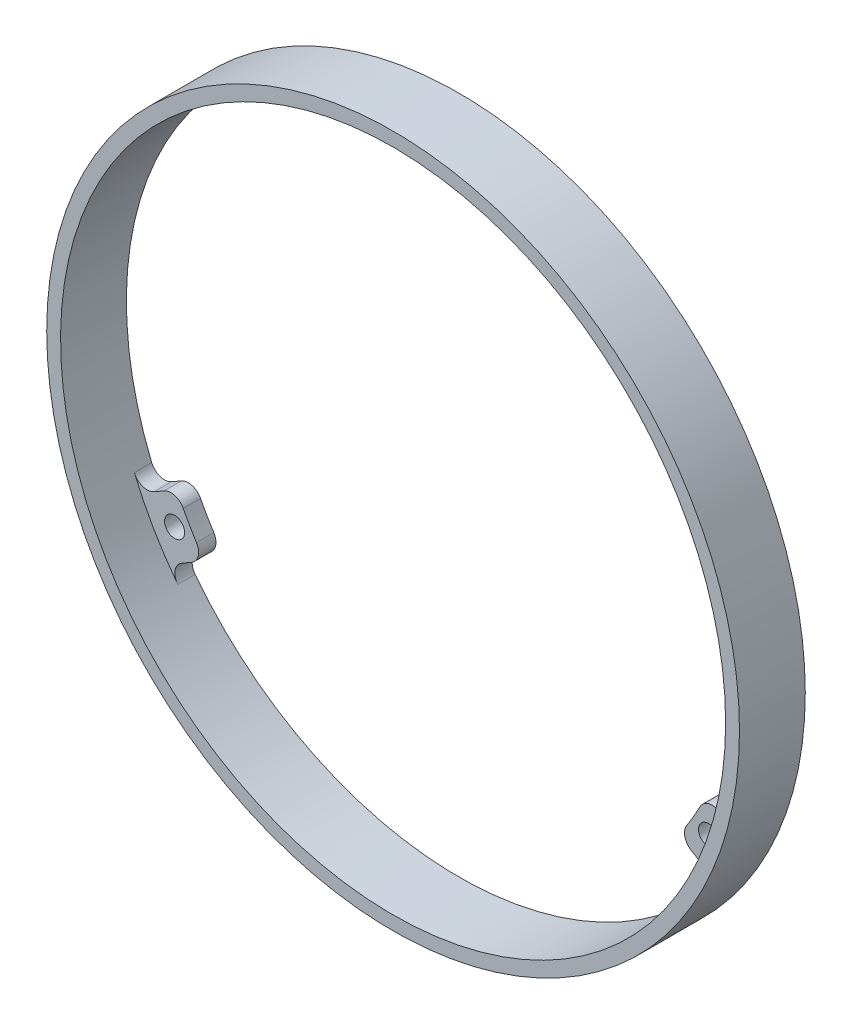
ISO-10303-21;
HEADER;
FILE_DESCRIPTION(('STEP AP214'),'2;1');
FILE_NAME('part.step','',(''),(''),'','','');
FILE_SCHEMA(('AUTOMOTIVE_DESIGN { 1 0 10303 214 1 1 1 1 }'));
ENDSEC;
DATA;
#1=APPLICATION_CONTEXT('core data for automotive mechanical design processes');
#2=APPLICATION_PROTOCOL_DEFINITION('international standard','automotive_design',2000,#1);
#3=PRODUCT_CONTEXT('',#1,'mechanical');
#4=PRODUCT('Part','Part','',(#3));
#5=PRODUCT_RELATED_PRODUCT_CATEGORY('part','',(#4));
#6=PRODUCT_DEFINITION_FORMATION('','',#4);
#7=PRODUCT_DEFINITION_CONTEXT('part definition',#1,'design');
#8=PRODUCT_DEFINITION('design','',#6,#7);
#9=PRODUCT_DEFINITION_SHAPE('','',#8);
#10=(LENGTH_UNIT() NAMED_UNIT(*) SI_UNIT(.MILLI.,.METRE.));
#11=(NAMED_UNIT(*) PLANE_ANGLE_UNIT() SI_UNIT($,.RADIAN.));
#12=(NAMED_UNIT(*) SI_UNIT($,.STERADIAN.) SOLID_ANGLE_UNIT());
#13=UNCERTAINTY_MEASURE_WITH_UNIT(LENGTH_MEASURE(1.E-05),#10,'distance_accuracy_value','');
#14=(GEOMETRIC_REPRESENTATION_CONTEXT(3) GLOBAL_UNCERTAINTY_ASSIGNED_CONTEXT((#13)) GLOBAL_UNIT_ASSIGNED_CONTEXT((#10,
#11,#12)) REPRESENTATION_CONTEXT('',''));
#15=CARTESIAN_POINT('',(0.,0.,0.));
#16=DIRECTION('',(0.,0.,1.));
#17=DIRECTION('',(1.,0.,0.));
#18=AXIS2_PLACEMENT_3D('',#15,#16,#17);
#19=CARTESIAN_POINT('',(0.,0.,9.5));
#20=DIRECTION('',(0.,0.,-1.));
#21=DIRECTION('',(-1.,0.,0.));
#22=AXIS2_PLACEMENT_3D('',#19,#20,#21);
#23=CYLINDRICAL_SURFACE('',#22,48.);
#24=CARTESIAN_POINT('',(0.,0.,9.5));
#25=DIRECTION('',(0.,0.,1.));
#26=DIRECTION('',(1.,0.,0.));
#27=AXIS2_PLACEMENT_3D('',#24,#25,#26);
#28=CIRCLE('',#27,48.);
#29=CARTESIAN_POINT('',(48.,0.,9.5));
#30=VERTEX_POINT('',#29);
#31=EDGE_CURVE('E238',#30,#30,#28,.T.);
#32=ORIENTED_EDGE('',*,*,#31,.T.);
#33=EDGE_LOOP('',(#32));
#34=FACE_BOUND('',#33,.T.);
#35=CARTESIAN_POINT('',(0.,0.,0.));
#36=DIRECTION('',(0.,0.,1.));
#37=DIRECTION('',(1.,0.,0.));
#38=AXIS2_PLACEMENT_3D('',#35,#36,#37);
#39=CIRCLE('',#38,48.);
#40=CARTESIAN_POINT('',(44.3445238082748,-18.3728933001134,0.));
#41=VERTEX_POINT('',#40);
#42=CARTESIAN_POINT('',(6.26086956521696,47.5899307867467,0.));
#43=VERTEX_POINT('',#42);
#44=EDGE_CURVE('E245',#41,#43,#39,.T.);
#45=ORIENTED_EDGE('',*,*,#44,.F.);
#46=DIRECTION('',(0.,0.,-1.));
#47=VECTOR('',#46,1.);
#48=CARTESIAN_POINT('',(44.3445238082748,-18.3728933001134,9.5));
#49=LINE('',#48,#47);
#50=CARTESIAN_POINT('',(44.3445238082748,-18.3728933001134,2.5));
#51=VERTEX_POINT('',#50);
#52=EDGE_CURVE('E323',#41,#51,#49,.F.);
#53=ORIENTED_EDGE('',*,*,#52,.T.);
#54=CARTESIAN_POINT('',(0.,0.,2.5));
#55=DIRECTION('',(0.,0.,1.));
#56=DIRECTION('',(-0.499999999999992,-0.866025403784443,0.));
#57=AXIS2_PLACEMENT_3D('',#54,#55,#56);
#58=CIRCLE('',#57,48.);
#59=CARTESIAN_POINT('',(38.0836542430576,-29.2170374866317,2.5));
#60=VERTEX_POINT('',#59);
#61=EDGE_CURVE('E357',#60,#51,#58,.T.);
#62=ORIENTED_EDGE('',*,*,#61,.F.);
#63=DIRECTION('',(0.,0.,-1.));
#64=VECTOR('',#63,1.);
#65=CARTESIAN_POINT('',(38.0836542430576,-29.2170374866317,9.5));
#66=LINE('',#65,#64);
#67=CARTESIAN_POINT('',(38.0836542430576,-29.2170374866317,0.));
#68=VERTEX_POINT('',#67);
#69=EDGE_CURVE('E320',#60,#68,#66,.T.);
#70=ORIENTED_EDGE('',*,*,#69,.T.);
#71=CARTESIAN_POINT('',(-38.0836542430566,-29.2170374866329,0.));
#72=VERTEX_POINT('',#71);
#73=EDGE_CURVE('E244',#72,#68,#39,.T.);
#74=ORIENTED_EDGE('',*,*,#73,.F.);
#75=DIRECTION('',(0.,0.,-1.));
#76=VECTOR('',#75,1.);
#77=CARTESIAN_POINT('',(-38.0836542430566,-29.2170374866329,9.5));
#78=LINE('',#77,#76);
#79=CARTESIAN_POINT('',(-38.0836542430566,-29.2170374866329,2.5));
#80=VERTEX_POINT('',#79);
#81=EDGE_CURVE('E285',#72,#80,#78,.F.);
#82=ORIENTED_EDGE('',*,*,#81,.T.);
#83=CARTESIAN_POINT('',(0.,0.,2.5));
#84=DIRECTION('',(0.,0.,1.));
#85=DIRECTION('',(-0.500000000000004,0.866025403784436,0.));
#86=AXIS2_PLACEMENT_3D('',#83,#84,#85);
#87=CIRCLE('',#86,48.);
#88=CARTESIAN_POINT('',(-44.3445238082742,-18.3728933001148,2.5));
#89=VERTEX_POINT('',#88);
#90=EDGE_CURVE('E380',#89,#80,#87,.T.);
#91=ORIENTED_EDGE('',*,*,#90,.F.);
#92=DIRECTION('',(0.,0.,-1.));
#93=VECTOR('',#92,1.);
#94=CARTESIAN_POINT('',(-44.3445238082742,-18.3728933001148,9.5));
#95=LINE('',#94,#93);
#96=CARTESIAN_POINT('',(-44.3445238082742,-18.3728933001148,0.));
#97=VERTEX_POINT('',#96);
#98=EDGE_CURVE('E282',#89,#97,#95,.T.);
#99=ORIENTED_EDGE('',*,*,#98,.T.);
#100=CARTESIAN_POINT('',(-6.26086956521783,47.5899307867466,0.));
#101=VERTEX_POINT('',#100);
#102=EDGE_CURVE('E242',#101,#97,#39,.T.);
#103=ORIENTED_EDGE('',*,*,#102,.F.);
#104=DIRECTION('',(0.,0.,-1.));
#105=VECTOR('',#104,1.);
#106=CARTESIAN_POINT('',(-6.26086956521783,47.5899307867466,9.5));
#107=LINE('',#106,#105);
#108=CARTESIAN_POINT('',(-6.26086956521783,47.5899307867466,2.5));
#109=VERTEX_POINT('',#108);
#110=EDGE_CURVE('E199',#101,#109,#107,.F.);
#111=ORIENTED_EDGE('',*,*,#110,.T.);
#112=CARTESIAN_POINT('',(0.,0.,2.5));
#113=DIRECTION('',(0.,0.,1.));
#114=DIRECTION('',(1.,0.,0.));
#115=AXIS2_PLACEMENT_3D('',#112,#113,#114);
#116=CIRCLE('',#115,48.);
#117=CARTESIAN_POINT('',(6.26086956521695,47.5899307867467,2.5));
#118=VERTEX_POINT('',#117);
#119=EDGE_CURVE('E237',#118,#109,#116,.T.);
#120=ORIENTED_EDGE('',*,*,#119,.F.);
#121=DIRECTION('',(0.,0.,-1.));
#122=VECTOR('',#121,1.);
#123=CARTESIAN_POINT('',(6.26086956521696,47.5899307867467,9.5));
#124=LINE('',#123,#122);
#125=EDGE_CURVE('E215',#118,#43,#124,.T.);
#126=ORIENTED_EDGE('',*,*,#125,.T.);
#127=EDGE_LOOP('',(#45,#53,#62,#70,#74,#82,#91,#99,#103,#111,#120,#126));
#128=FACE_BOUND('',#127,.T.);
#129=ADVANCED_FACE('F30',(#34,#128),#23,.F.);
#130=CARTESIAN_POINT('',(0.,0.,9.5));
#131=DIRECTION('',(0.,0.,1.));
#132=DIRECTION('',(1.,0.,0.));
#133=AXIS2_PLACEMENT_3D('',#130,#131,#132);
#134=PLANE('',#133);
#135=CARTESIAN_POINT('',(0.,0.,9.5));
#136=DIRECTION('',(0.,0.,1.));
#137=DIRECTION('',(1.,0.,0.));
#138=AXIS2_PLACEMENT_3D('',#135,#136,#137);
#139=CIRCLE('',#138,50.);
#140=CARTESIAN_POINT('',(50.,0.,9.5));
#141=VERTEX_POINT('',#140);
#142=EDGE_CURVE('E246',#141,#141,#139,.T.);
#143=ORIENTED_EDGE('',*,*,#142,.T.);
#144=EDGE_LOOP('',(#143));
#145=FACE_BOUND('',#144,.T.);
#146=ORIENTED_EDGE('',*,*,#31,.F.);
#147=EDGE_LOOP('',(#146));
#148=FACE_BOUND('',#147,.T.);
#149=ADVANCED_FACE('F434',(#145,#148),#134,.T.);
#150=CARTESIAN_POINT('',(0.,0.,0.));
#151=DIRECTION('',(0.,0.,1.));
#152=DIRECTION('',(1.,0.,0.));
#153=AXIS2_PLACEMENT_3D('',#150,#151,#152);
#154=PLANE('',#153);
#155=CARTESIAN_POINT('',(38.5381304684077,-22.2499999999996,0.));
#156=DIRECTION('',(0.,0.,1.));
#157=DIRECTION('',(-0.499999999999992,-0.866025403784443,0.));
#158=AXIS2_PLACEMENT_3D('',#155,#156,#157);
#159=CIRCLE('',#158,1.45);
#160=CARTESIAN_POINT('',(37.8131304684077,-23.5057368354871,0.));
#161=VERTEX_POINT('',#160);
#162=EDGE_CURVE('E508',#161,#161,#159,.T.);
#163=ORIENTED_EDGE('',*,*,#162,.T.);
#164=EDGE_LOOP('',(#163));
#165=FACE_BOUND('',#164,.T.);
#166=CARTESIAN_POINT('',(-38.5381304684074,-22.2500000000002,0.));
#167=DIRECTION('',(0.,0.,1.));
#168=DIRECTION('',(-0.500000000000004,0.866025403784436,0.));
#169=AXIS2_PLACEMENT_3D('',#166,#167,#168);
#170=CIRCLE('',#169,1.45);
#171=CARTESIAN_POINT('',(-39.2631304684074,-20.9942631645127,0.));
#172=VERTEX_POINT('',#171);
#173=EDGE_CURVE('E378',#172,#172,#170,.T.);
#174=ORIENTED_EDGE('',*,*,#173,.T.);
#175=EDGE_LOOP('',(#174));
#176=FACE_BOUND('',#175,.T.);
#177=CARTESIAN_POINT('',(0.,44.5,0.));
#178=DIRECTION('',(0.,0.,1.));
#179=DIRECTION('',(1.,0.,0.));
#180=AXIS2_PLACEMENT_3D('',#177,#178,#179);
#181=CIRCLE('',#180,1.45);
#182=CARTESIAN_POINT('',(1.45,44.5,0.));
#183=VERTEX_POINT('',#182);
#184=EDGE_CURVE('E223',#183,#183,#181,.T.);
#185=ORIENTED_EDGE('',*,*,#184,.T.);
#186=EDGE_LOOP('',(#185));
#187=FACE_BOUND('',#186,.T.);
#188=CARTESIAN_POINT('',(0.,0.,0.));
#189=DIRECTION('',(0.,0.,1.));
#190=DIRECTION('',(1.,0.,0.));
#191=AXIS2_PLACEMENT_3D('',#188,#189,#190);
#192=CIRCLE('',#191,50.);
#193=CARTESIAN_POINT('',(50.,0.,0.));
#194=VERTEX_POINT('',#193);
#195=EDGE_CURVE('E241',#194,#194,#192,.T.);
#196=ORIENTED_EDGE('',*,*,#195,.F.);
#197=EDGE_LOOP('',(#196));
#198=FACE_BOUND('',#197,.T.);
#199=DIRECTION('',(0.866025403784439,-0.5,0.));
#200=VECTOR('',#199,1.);
#201=CARTESIAN_POINT('',(39.4246303544165,-27.3806231013399,0.));
#202=LINE('',#201,#200);
#203=CARTESIAN_POINT('',(36.065732621349,-25.441362590973,0.));
#204=VERTEX_POINT('',#203);
#205=CARTESIAN_POINT('',(37.4968353162635,-26.2676101171198,0.));
#206=VERTEX_POINT('',#205);
#207=EDGE_CURVE('E347',#204,#206,#202,.T.);
#208=ORIENTED_EDGE('',*,*,#207,.F.);
#209=CARTESIAN_POINT('',(37.065732621349,-23.7093117834041,0.));
#210=DIRECTION('',(0.,0.,1.));
#211=DIRECTION('',(1.,0.,0.));
#212=AXIS2_PLACEMENT_3D('',#209,#210,#211);
#213=CIRCLE('',#212,2.);
#214=CARTESIAN_POINT('',(35.3809265931059,-22.6316157932493,0.));
#215=VERTEX_POINT('',#214);
#216=EDGE_CURVE('E333',#204,#215,#213,.F.);
#217=ORIENTED_EDGE('',*,*,#216,.T.);
#218=CARTESIAN_POINT('',(0.,0.,0.));
#219=DIRECTION('',(0.,0.,-1.));
#220=DIRECTION('',(-0.499999999999992,-0.866025403784443,0.));
#221=AXIS2_PLACEMENT_3D('',#218,#219,#220);
#222=CIRCLE('',#221,42.);
#223=CARTESIAN_POINT('',(37.2900175021967,-19.324973342436,0.));
#224=VERTEX_POINT('',#223);
#225=EDGE_CURVE('E358',#224,#215,#222,.T.);
#226=ORIENTED_EDGE('',*,*,#225,.F.);
#227=CARTESIAN_POINT('',(39.0657326213489,-20.2452101682663,0.));
#228=DIRECTION('',(0.,0.,1.));
#229=DIRECTION('',(1.,0.,0.));
#230=AXIS2_PLACEMENT_3D('',#227,#228,#229);
#231=CIRCLE('',#230,2.);
#232=CARTESIAN_POINT('',(40.0657326213489,-18.5131593606974,0.));
#233=VERTEX_POINT('',#232);
#234=EDGE_CURVE('E331',#224,#233,#231,.F.);
#235=ORIENTED_EDGE('',*,*,#234,.T.);
#236=DIRECTION('',(-0.866025403784439,0.5,0.));
#237=VECTOR('',#236,1.);
#238=CARTESIAN_POINT('',(43.4246303544163,-20.4524198710643,0.));
#239=LINE('',#238,#237);
#240=CARTESIAN_POINT('',(41.4968353162633,-19.3394068868442,0.));
#241=VERTEX_POINT('',#240);
#242=EDGE_CURVE('E375',#241,#233,#239,.T.);
#243=ORIENTED_EDGE('',*,*,#242,.F.);
#244=CARTESIAN_POINT('',(42.4968353162633,-17.6073560792753,0.));
#245=DIRECTION('',(0.,0.,1.));
#246=DIRECTION('',(1.,0.,0.));
#247=AXIS2_PLACEMENT_3D('',#244,#245,#246);
#248=CIRCLE('',#247,2.);
#249=EDGE_CURVE('E342',#241,#41,#248,.T.);
#250=ORIENTED_EDGE('',*,*,#249,.T.);
#251=ORIENTED_EDGE('',*,*,#44,.T.);
#252=CARTESIAN_POINT('',(5.99999999999958,45.6070170039656,0.));
#253=DIRECTION('',(0.,0.,1.));
#254=DIRECTION('',(1.,0.,0.));
#255=AXIS2_PLACEMENT_3D('',#252,#253,#254);
#256=CIRCLE('',#255,2.);
#257=CARTESIAN_POINT('',(3.99999999999958,45.6070170039656,0.));
#258=VERTEX_POINT('',#257);
#259=EDGE_CURVE('E272',#43,#258,#256,.T.);
#260=ORIENTED_EDGE('',*,*,#259,.T.);
#261=DIRECTION('',(0.,1.,0.));
#262=VECTOR('',#261,1.);
#263=CARTESIAN_POINT('',(3.9999999999996,47.8330429724056,0.));
#264=LINE('',#263,#262);
#265=CARTESIAN_POINT('',(3.99999999999957,43.9545219516718,0.));
#266=VERTEX_POINT('',#265);
#267=EDGE_CURVE('E226',#266,#258,#264,.T.);
#268=ORIENTED_EDGE('',*,*,#267,.F.);
#269=CARTESIAN_POINT('',(1.99999999999957,43.9545219516719,0.));
#270=DIRECTION('',(0.,0.,1.));
#271=DIRECTION('',(1.,0.,0.));
#272=AXIS2_PLACEMENT_3D('',#269,#270,#271);
#273=CIRCLE('',#272,2.);
#274=CARTESIAN_POINT('',(1.9090909090905,41.9565891356868,0.));
#275=VERTEX_POINT('',#274);
#276=EDGE_CURVE('E261',#266,#275,#273,.F.);
#277=ORIENTED_EDGE('',*,*,#276,.T.);
#278=CARTESIAN_POINT('',(0.,0.,0.));
#279=DIRECTION('',(0.,0.,-1.));
#280=DIRECTION('',(1.,0.,0.));
#281=AXIS2_PLACEMENT_3D('',#278,#279,#280);
#282=CIRCLE('',#281,42.);
#283=CARTESIAN_POINT('',(-1.90909090909132,41.9565891356867,0.));
#284=VERTEX_POINT('',#283);
#285=EDGE_CURVE('E222',#284,#275,#282,.T.);
#286=ORIENTED_EDGE('',*,*,#285,.F.);
#287=CARTESIAN_POINT('',(-2.00000000000043,43.9545219516718,0.));
#288=DIRECTION('',(0.,0.,1.));
#289=DIRECTION('',(1.,0.,0.));
#290=AXIS2_PLACEMENT_3D('',#287,#288,#289);
#291=CIRCLE('',#290,2.);
#292=CARTESIAN_POINT('',(-4.00000000000043,43.9545219516718,0.));
#293=VERTEX_POINT('',#292);
#294=EDGE_CURVE('E221',#284,#293,#291,.F.);
#295=ORIENTED_EDGE('',*,*,#294,.T.);
#296=DIRECTION('',(0.,-1.,0.));
#297=VECTOR('',#296,1.);
#298=CARTESIAN_POINT('',(-4.0000000000004,47.8330429724056,0.));
#299=LINE('',#298,#297);
#300=CARTESIAN_POINT('',(-4.00000000000042,45.6070170039655,0.));
#301=VERTEX_POINT('',#300);
#302=EDGE_CURVE('E211',#301,#293,#299,.T.);
#303=ORIENTED_EDGE('',*,*,#302,.F.);
#304=CARTESIAN_POINT('',(-6.00000000000042,45.6070170039655,0.));
#305=DIRECTION('',(0.,0.,1.));
#306=DIRECTION('',(1.,0.,0.));
#307=AXIS2_PLACEMENT_3D('',#304,#305,#306);
#308=CIRCLE('',#307,2.);
#309=EDGE_CURVE('E193',#301,#101,#308,.T.);
#310=ORIENTED_EDGE('',*,*,#309,.T.);
#311=ORIENTED_EDGE('',*,*,#102,.T.);
#312=CARTESIAN_POINT('',(-42.4968353162628,-17.6073560792767,0.));
#313=DIRECTION('',(0.,0.,1.));
#314=DIRECTION('',(1.,0.,0.));
#315=AXIS2_PLACEMENT_3D('',#312,#313,#314);
#316=CIRCLE('',#315,2.);
#317=CARTESIAN_POINT('',(-41.4968353162628,-19.3394068868456,0.));
#318=VERTEX_POINT('',#317);
#319=EDGE_CURVE('E310',#97,#318,#316,.T.);
#320=ORIENTED_EDGE('',*,*,#319,.T.);
#321=DIRECTION('',(-0.866025403784441,-0.499999999999997,0.));
#322=VECTOR('',#321,1.);
#323=CARTESIAN_POINT('',(-43.4246303544157,-20.4524198710656,0.));
#324=LINE('',#323,#322);
#325=CARTESIAN_POINT('',(-40.0657326213483,-18.5131593606987,0.));
#326=VERTEX_POINT('',#325);
#327=EDGE_CURVE('E383',#326,#318,#324,.T.);
#328=ORIENTED_EDGE('',*,*,#327,.F.);
#329=CARTESIAN_POINT('',(-39.0657326213483,-20.2452101682676,0.));
#330=DIRECTION('',(0.,0.,1.));
#331=DIRECTION('',(1.,0.,0.));
#332=AXIS2_PLACEMENT_3D('',#329,#330,#331);
#333=CIRCLE('',#332,2.);
#334=CARTESIAN_POINT('',(-37.2900175021961,-19.3249733424373,0.));
#335=VERTEX_POINT('',#334);
#336=EDGE_CURVE('E295',#326,#335,#333,.F.);
#337=ORIENTED_EDGE('',*,*,#336,.T.);
#338=CARTESIAN_POINT('',(0.,0.,0.));
#339=DIRECTION('',(0.,0.,-1.));
#340=DIRECTION('',(-0.500000000000004,0.866025403784436,0.));
#341=AXIS2_PLACEMENT_3D('',#338,#339,#340);
#342=CIRCLE('',#341,42.);
#343=CARTESIAN_POINT('',(-35.3809265931051,-22.6316157932505,0.));
#344=VERTEX_POINT('',#343);
#345=EDGE_CURVE('E369',#344,#335,#342,.T.);
#346=ORIENTED_EDGE('',*,*,#345,.F.);
#347=CARTESIAN_POINT('',(-37.0657326213482,-23.7093117834053,0.));
#348=DIRECTION('',(0.,0.,1.));
#349=DIRECTION('',(1.,0.,0.));
#350=AXIS2_PLACEMENT_3D('',#347,#348,#349);
#351=CIRCLE('',#350,2.);
#352=CARTESIAN_POINT('',(-36.0657326213482,-25.4413625909742,0.));
#353=VERTEX_POINT('',#352);
#354=EDGE_CURVE('E293',#344,#353,#351,.F.);
#355=ORIENTED_EDGE('',*,*,#354,.T.);
#356=DIRECTION('',(0.866025403784441,0.499999999999996,0.));
#357=VECTOR('',#356,1.);
#358=CARTESIAN_POINT('',(-39.4246303544156,-27.3806231013411,0.));
#359=LINE('',#358,#357);
#360=CARTESIAN_POINT('',(-37.4968353162626,-26.267610117121,0.));
#361=VERTEX_POINT('',#360);
#362=EDGE_CURVE('E365',#361,#353,#359,.T.);
#363=ORIENTED_EDGE('',*,*,#362,.F.);
#364=CARTESIAN_POINT('',(-36.4968353162626,-27.9996609246899,0.));
#365=DIRECTION('',(0.,0.,1.));
#366=DIRECTION('',(1.,0.,0.));
#367=AXIS2_PLACEMENT_3D('',#364,#365,#366);
#368=CIRCLE('',#367,2.);
#369=EDGE_CURVE('E306',#361,#72,#368,.T.);
#370=ORIENTED_EDGE('',*,*,#369,.T.);
#371=ORIENTED_EDGE('',*,*,#73,.T.);
#372=CARTESIAN_POINT('',(36.4968353162635,-27.9996609246887,0.));
#373=DIRECTION('',(0.,0.,1.));
#374=DIRECTION('',(1.,0.,0.));
#375=AXIS2_PLACEMENT_3D('',#372,#373,#374);
#376=CIRCLE('',#375,2.);
#377=EDGE_CURVE('E38',#68,#206,#376,.T.);
#378=ORIENTED_EDGE('',*,*,#377,.T.);
#379=EDGE_LOOP('',(#208,#217,#226,#235,#243,#250,#251,#260,#268,#277,#286,#295,#303,#310,#311,
#320,#328,#337,#346,#355,#363,#370,#371,#378));
#380=FACE_BOUND('',#379,.T.);
#381=ADVANCED_FACE('F219',(#165,#176,#187,#198,#380),#154,.F.);
#382=CARTESIAN_POINT('',(0.,0.,9.5));
#383=DIRECTION('',(0.,0.,-1.));
#384=DIRECTION('',(-1.,0.,0.));
#385=AXIS2_PLACEMENT_3D('',#382,#383,#384);
#386=CYLINDRICAL_SURFACE('',#385,50.);
#387=ORIENTED_EDGE('',*,*,#142,.F.);
#388=EDGE_LOOP('',(#387));
#389=FACE_BOUND('',#388,.T.);
#390=ORIENTED_EDGE('',*,*,#195,.T.);
#391=EDGE_LOOP('',(#390));
#392=FACE_BOUND('',#391,.T.);
#393=ADVANCED_FACE('F447',(#389,#392),#386,.T.);
#394=CARTESIAN_POINT('',(-4.0000000000004,47.8330429724056,2.5));
#395=DIRECTION('',(1.,0.,0.));
#396=DIRECTION('',(0.,1.,0.));
#397=AXIS2_PLACEMENT_3D('',#394,#395,#396);
#398=PLANE('',#397);
#399=DIRECTION('',(0.,-1.,0.));
#400=VECTOR('',#399,1.);
#401=CARTESIAN_POINT('',(-4.0000000000004,47.8330429724056,2.5));
#402=LINE('',#401,#400);
#403=CARTESIAN_POINT('',(-4.00000000000042,45.6070170039655,2.5));
#404=VERTEX_POINT('',#403);
#405=CARTESIAN_POINT('',(-4.00000000000043,43.9545219516718,2.5));
#406=VERTEX_POINT('',#405);
#407=EDGE_CURVE('E214',#404,#406,#402,.T.);
#408=ORIENTED_EDGE('',*,*,#407,.F.);
#409=DIRECTION('',(0.,0.,-1.));
#410=VECTOR('',#409,1.);
#411=CARTESIAN_POINT('',(-4.00000000000042,45.6070170039655,2.5));
#412=LINE('',#411,#410);
#413=EDGE_CURVE('E197',#404,#301,#412,.T.);
#414=ORIENTED_EDGE('',*,*,#413,.T.);
#415=ORIENTED_EDGE('',*,*,#302,.T.);
#416=DIRECTION('',(0.,0.,-1.));
#417=VECTOR('',#416,1.);
#418=CARTESIAN_POINT('',(-4.00000000000043,43.9545219516718,2.5));
#419=LINE('',#418,#417);
#420=EDGE_CURVE('E216',#293,#406,#419,.F.);
#421=ORIENTED_EDGE('',*,*,#420,.T.);
#422=EDGE_LOOP('',(#408,#414,#415,#421));
#423=FACE_BOUND('',#422,.T.);
#424=ADVANCED_FACE('F210',(#423),#398,.F.);
#425=CARTESIAN_POINT('',(0.,0.,2.5));
#426=DIRECTION('',(0.,0.,-1.));
#427=DIRECTION('',(-1.,0.,0.));
#428=AXIS2_PLACEMENT_3D('',#425,#426,#427);
#429=CYLINDRICAL_SURFACE('',#428,42.);
#430=ORIENTED_EDGE('',*,*,#285,.T.);
#431=DIRECTION('',(0.,0.,-1.));
#432=VECTOR('',#431,1.);
#433=CARTESIAN_POINT('',(1.9090909090905,41.9565891356868,2.5));
#434=LINE('',#433,#432);
#435=CARTESIAN_POINT('',(1.9090909090905,41.9565891356868,2.5));
#436=VERTEX_POINT('',#435);
#437=EDGE_CURVE('E266',#275,#436,#434,.F.);
#438=ORIENTED_EDGE('',*,*,#437,.T.);
#439=CARTESIAN_POINT('',(0.,0.,2.5));
#440=DIRECTION('',(0.,0.,-1.));
#441=DIRECTION('',(1.,0.,0.));
#442=AXIS2_PLACEMENT_3D('',#439,#440,#441);
#443=CIRCLE('',#442,42.);
#444=CARTESIAN_POINT('',(-1.90909090909132,41.9565891356867,2.5));
#445=VERTEX_POINT('',#444);
#446=EDGE_CURVE('E399',#445,#436,#443,.T.);
#447=ORIENTED_EDGE('',*,*,#446,.F.);
#448=DIRECTION('',(0.,0.,-1.));
#449=VECTOR('',#448,1.);
#450=CARTESIAN_POINT('',(-1.90909090909132,41.9565891356867,2.5));
#451=LINE('',#450,#449);
#452=EDGE_CURVE('E263',#445,#284,#451,.T.);
#453=ORIENTED_EDGE('',*,*,#452,.T.);
#454=EDGE_LOOP('',(#430,#438,#447,#453));
#455=FACE_BOUND('',#454,.T.);
#456=ADVANCED_FACE('F429',(#455),#429,.F.);
#457=CARTESIAN_POINT('',(3.9999999999996,47.8330429724056,2.5));
#458=DIRECTION('',(-1.,0.,0.));
#459=DIRECTION('',(0.,-1.,0.));
#460=AXIS2_PLACEMENT_3D('',#457,#458,#459);
#461=PLANE('',#460);
#462=ORIENTED_EDGE('',*,*,#267,.T.);
#463=DIRECTION('',(0.,0.,-1.));
#464=VECTOR('',#463,1.);
#465=CARTESIAN_POINT('',(3.99999999999958,45.6070170039656,2.5));
#466=LINE('',#465,#464);
#467=CARTESIAN_POINT('',(3.99999999999958,45.6070170039656,2.5));
#468=VERTEX_POINT('',#467);
#469=EDGE_CURVE('E258',#258,#468,#466,.F.);
#470=ORIENTED_EDGE('',*,*,#469,.T.);
#471=DIRECTION('',(0.,1.,0.));
#472=VECTOR('',#471,1.);
#473=CARTESIAN_POINT('',(3.9999999999996,47.8330429724056,2.5));
#474=LINE('',#473,#472);
#475=CARTESIAN_POINT('',(3.99999999999957,43.9545219516718,2.5));
#476=VERTEX_POINT('',#475);
#477=EDGE_CURVE('E232',#476,#468,#474,.T.);
#478=ORIENTED_EDGE('',*,*,#477,.F.);
#479=DIRECTION('',(0.,0.,-1.));
#480=VECTOR('',#479,1.);
#481=CARTESIAN_POINT('',(3.99999999999957,43.9545219516718,2.5));
#482=LINE('',#481,#480);
#483=EDGE_CURVE('E255',#476,#266,#482,.T.);
#484=ORIENTED_EDGE('',*,*,#483,.T.);
#485=EDGE_LOOP('',(#462,#470,#478,#484));
#486=FACE_BOUND('',#485,.T.);
#487=ADVANCED_FACE('F420',(#486),#461,.F.);
#488=CARTESIAN_POINT('',(0.,0.,2.5));
#489=DIRECTION('',(0.,0.,1.));
#490=DIRECTION('',(1.,0.,0.));
#491=AXIS2_PLACEMENT_3D('',#488,#489,#490);
#492=PLANE('',#491);
#493=CARTESIAN_POINT('',(0.,44.5,2.5));
#494=DIRECTION('',(0.,0.,1.));
#495=DIRECTION('',(1.,0.,0.));
#496=AXIS2_PLACEMENT_3D('',#493,#494,#495);
#497=CIRCLE('',#496,1.45);
#498=CARTESIAN_POINT('',(1.45,44.5,2.5));
#499=VERTEX_POINT('',#498);
#500=EDGE_CURVE('E229',#499,#499,#497,.T.);
#501=ORIENTED_EDGE('',*,*,#500,.F.);
#502=EDGE_LOOP('',(#501));
#503=FACE_BOUND('',#502,.T.);
#504=ORIENTED_EDGE('',*,*,#446,.T.);
#505=CARTESIAN_POINT('',(1.99999999999957,43.9545219516719,2.5));
#506=DIRECTION('',(0.,0.,1.));
#507=DIRECTION('',(1.,0.,0.));
#508=AXIS2_PLACEMENT_3D('',#505,#506,#507);
#509=CIRCLE('',#508,2.);
#510=EDGE_CURVE('E205',#436,#476,#509,.T.);
#511=ORIENTED_EDGE('',*,*,#510,.T.);
#512=ORIENTED_EDGE('',*,*,#477,.T.);
#513=CARTESIAN_POINT('',(5.99999999999958,45.6070170039656,2.5));
#514=DIRECTION('',(0.,0.,1.));
#515=DIRECTION('',(1.,0.,0.));
#516=AXIS2_PLACEMENT_3D('',#513,#514,#515);
#517=CIRCLE('',#516,2.);
#518=EDGE_CURVE('E274',#468,#118,#517,.F.);
#519=ORIENTED_EDGE('',*,*,#518,.T.);
#520=ORIENTED_EDGE('',*,*,#119,.T.);
#521=CARTESIAN_POINT('',(-6.00000000000042,45.6070170039655,2.5));
#522=DIRECTION('',(0.,0.,1.));
#523=DIRECTION('',(1.,0.,0.));
#524=AXIS2_PLACEMENT_3D('',#521,#522,#523);
#525=CIRCLE('',#524,2.);
#526=EDGE_CURVE('E204',#109,#404,#525,.F.);
#527=ORIENTED_EDGE('',*,*,#526,.T.);
#528=ORIENTED_EDGE('',*,*,#407,.T.);
#529=CARTESIAN_POINT('',(-2.00000000000043,43.9545219516718,2.5));
#530=DIRECTION('',(0.,0.,1.));
#531=DIRECTION('',(1.,0.,0.));
#532=AXIS2_PLACEMENT_3D('',#529,#530,#531);
#533=CIRCLE('',#532,2.);
#534=EDGE_CURVE('E268',#406,#445,#533,.T.);
#535=ORIENTED_EDGE('',*,*,#534,.T.);
#536=EDGE_LOOP('',(#504,#511,#512,#519,#520,#527,#528,#535));
#537=FACE_BOUND('',#536,.T.);
#538=ADVANCED_FACE('F417',(#503,#537),#492,.T.);
#539=CARTESIAN_POINT('',(0.,44.5,0.));
#540=DIRECTION('',(0.,0.,1.));
#541=DIRECTION('',(1.,0.,0.));
#542=AXIS2_PLACEMENT_3D('',#539,#540,#541);
#543=CYLINDRICAL_SURFACE('',#542,1.45);
#544=ORIENTED_EDGE('',*,*,#184,.F.);
#545=EDGE_LOOP('',(#544));
#546=FACE_BOUND('',#545,.T.);
#547=ORIENTED_EDGE('',*,*,#500,.T.);
#548=EDGE_LOOP('',(#547));
#549=FACE_BOUND('',#548,.T.);
#550=ADVANCED_FACE('F419',(#546,#549),#543,.F.);
#551=CARTESIAN_POINT('',(-6.00000000000042,45.6070170039655,9.5));
#552=DIRECTION('',(0.,0.,-1.));
#553=DIRECTION('',(-1.,0.,0.));
#554=AXIS2_PLACEMENT_3D('',#551,#552,#553);
#555=CYLINDRICAL_SURFACE('',#554,2.);
#556=ORIENTED_EDGE('',*,*,#526,.F.);
#557=ORIENTED_EDGE('',*,*,#110,.F.);
#558=ORIENTED_EDGE('',*,*,#309,.F.);
#559=ORIENTED_EDGE('',*,*,#413,.F.);
#560=EDGE_LOOP('',(#556,#557,#558,#559));
#561=FACE_BOUND('',#560,.T.);
#562=ADVANCED_FACE('F196',(#561),#555,.F.);
#563=CARTESIAN_POINT('',(5.99999999999958,45.6070170039656,9.5));
#564=DIRECTION('',(0.,0.,-1.));
#565=DIRECTION('',(-1.,0.,0.));
#566=AXIS2_PLACEMENT_3D('',#563,#564,#565);
#567=CYLINDRICAL_SURFACE('',#566,2.);
#568=ORIENTED_EDGE('',*,*,#518,.F.);
#569=ORIENTED_EDGE('',*,*,#469,.F.);
#570=ORIENTED_EDGE('',*,*,#259,.F.);
#571=ORIENTED_EDGE('',*,*,#125,.F.);
#572=EDGE_LOOP('',(#568,#569,#570,#571));
#573=FACE_BOUND('',#572,.T.);
#574=ADVANCED_FACE('F416',(#573),#567,.F.);
#575=CARTESIAN_POINT('',(1.99999999999957,43.9545219516719,2.5));
#576=DIRECTION('',(0.,0.,-1.));
#577=DIRECTION('',(-1.,0.,0.));
#578=AXIS2_PLACEMENT_3D('',#575,#576,#577);
#579=CYLINDRICAL_SURFACE('',#578,2.);
#580=ORIENTED_EDGE('',*,*,#510,.F.);
#581=ORIENTED_EDGE('',*,*,#437,.F.);
#582=ORIENTED_EDGE('',*,*,#276,.F.);
#583=ORIENTED_EDGE('',*,*,#483,.F.);
#584=EDGE_LOOP('',(#580,#581,#582,#583));
#585=FACE_BOUND('',#584,.T.);
#586=ADVANCED_FACE('F456',(#585),#579,.T.);
#587=CARTESIAN_POINT('',(-2.00000000000043,43.9545219516718,2.5));
#588=DIRECTION('',(0.,0.,-1.));
#589=DIRECTION('',(-1.,0.,0.));
#590=AXIS2_PLACEMENT_3D('',#587,#588,#589);
#591=CYLINDRICAL_SURFACE('',#590,2.);
#592=ORIENTED_EDGE('',*,*,#534,.F.);
#593=ORIENTED_EDGE('',*,*,#420,.F.);
#594=ORIENTED_EDGE('',*,*,#294,.F.);
#595=ORIENTED_EDGE('',*,*,#452,.F.);
#596=EDGE_LOOP('',(#592,#593,#594,#595));
#597=FACE_BOUND('',#596,.T.);
#598=ADVANCED_FACE('F459',(#597),#591,.T.);
#599=CARTESIAN_POINT('',(-39.4246303544156,-27.3806231013411,2.5));
#600=DIRECTION('',(-0.499999999999996,0.866025403784441,0.));
#601=DIRECTION('',(-0.866025403784441,-0.499999999999996,0.));
#602=AXIS2_PLACEMENT_3D('',#599,#600,#601);
#603=PLANE('',#602);
#604=DIRECTION('',(0.866025403784441,0.499999999999996,0.));
#605=VECTOR('',#604,1.);
#606=CARTESIAN_POINT('',(-39.4246303544156,-27.3806231013411,2.5));
#607=LINE('',#606,#605);
#608=CARTESIAN_POINT('',(-37.4968353162626,-26.267610117121,2.5));
#609=VERTEX_POINT('',#608);
#610=CARTESIAN_POINT('',(-36.0657326213482,-25.4413625909742,2.5));
#611=VERTEX_POINT('',#610);
#612=EDGE_CURVE('E382',#609,#611,#607,.T.);
#613=ORIENTED_EDGE('',*,*,#612,.F.);
#614=DIRECTION('',(0.,0.,-1.));
#615=VECTOR('',#614,1.);
#616=CARTESIAN_POINT('',(-37.4968353162626,-26.267610117121,2.5));
#617=LINE('',#616,#615);
#618=EDGE_CURVE('E279',#609,#361,#617,.T.);
#619=ORIENTED_EDGE('',*,*,#618,.T.);
#620=ORIENTED_EDGE('',*,*,#362,.T.);
#621=DIRECTION('',(0.,0.,-1.));
#622=VECTOR('',#621,1.);
#623=CARTESIAN_POINT('',(-36.0657326213482,-25.4413625909742,2.5));
#624=LINE('',#623,#622);
#625=EDGE_CURVE('E277',#353,#611,#624,.F.);
#626=ORIENTED_EDGE('',*,*,#625,.T.);
#627=EDGE_LOOP('',(#613,#619,#620,#626));
#628=FACE_BOUND('',#627,.T.);
#629=ADVANCED_FACE('F463',(#628),#603,.F.);
#630=CARTESIAN_POINT('',(0.,0.,2.5));
#631=DIRECTION('',(0.,0.,-1.));
#632=DIRECTION('',(-1.,0.,0.));
#633=AXIS2_PLACEMENT_3D('',#630,#631,#632);
#634=CYLINDRICAL_SURFACE('',#633,42.);
#635=ORIENTED_EDGE('',*,*,#345,.T.);
#636=DIRECTION('',(0.,0.,-1.));
#637=VECTOR('',#636,1.);
#638=CARTESIAN_POINT('',(-37.2900175021961,-19.3249733424373,2.5));
#639=LINE('',#638,#637);
#640=CARTESIAN_POINT('',(-37.2900175021961,-19.3249733424373,2.5));
#641=VERTEX_POINT('',#640);
#642=EDGE_CURVE('E300',#335,#641,#639,.F.);
#643=ORIENTED_EDGE('',*,*,#642,.T.);
#644=CARTESIAN_POINT('',(0.,0.,2.5));
#645=DIRECTION('',(0.,0.,-1.));
#646=DIRECTION('',(-0.500000000000004,0.866025403784436,0.));
#647=AXIS2_PLACEMENT_3D('',#644,#645,#646);
#648=CIRCLE('',#647,42.);
#649=CARTESIAN_POINT('',(-35.3809265931051,-22.6316157932505,2.5));
#650=VERTEX_POINT('',#649);
#651=EDGE_CURVE('E386',#650,#641,#648,.T.);
#652=ORIENTED_EDGE('',*,*,#651,.F.);
#653=DIRECTION('',(0.,0.,-1.));
#654=VECTOR('',#653,1.);
#655=CARTESIAN_POINT('',(-35.3809265931051,-22.6316157932505,2.5));
#656=LINE('',#655,#654);
#657=EDGE_CURVE('E297',#650,#344,#656,.T.);
#658=ORIENTED_EDGE('',*,*,#657,.T.);
#659=EDGE_LOOP('',(#635,#643,#652,#658));
#660=FACE_BOUND('',#659,.T.);
#661=ADVANCED_FACE('F545',(#660),#634,.F.);
#662=CARTESIAN_POINT('',(-43.4246303544157,-20.4524198710656,2.5));
#663=DIRECTION('',(0.499999999999996,-0.866025403784441,0.));
#664=DIRECTION('',(0.866025403784441,0.499999999999996,0.));
#665=AXIS2_PLACEMENT_3D('',#662,#663,#664);
#666=PLANE('',#665);
#667=ORIENTED_EDGE('',*,*,#327,.T.);
#668=DIRECTION('',(0.,0.,-1.));
#669=VECTOR('',#668,1.);
#670=CARTESIAN_POINT('',(-41.4968353162628,-19.3394068868456,2.5));
#671=LINE('',#670,#669);
#672=CARTESIAN_POINT('',(-41.4968353162628,-19.3394068868456,2.5));
#673=VERTEX_POINT('',#672);
#674=EDGE_CURVE('E291',#318,#673,#671,.F.);
#675=ORIENTED_EDGE('',*,*,#674,.T.);
#676=DIRECTION('',(-0.866025403784441,-0.499999999999997,0.));
#677=VECTOR('',#676,1.);
#678=CARTESIAN_POINT('',(-43.4246303544157,-20.4524198710656,2.5));
#679=LINE('',#678,#677);
#680=CARTESIAN_POINT('',(-40.0657326213483,-18.5131593606987,2.5));
#681=VERTEX_POINT('',#680);
#682=EDGE_CURVE('E389',#681,#673,#679,.T.);
#683=ORIENTED_EDGE('',*,*,#682,.F.);
#684=DIRECTION('',(0.,0.,-1.));
#685=VECTOR('',#684,1.);
#686=CARTESIAN_POINT('',(-40.0657326213483,-18.5131593606987,2.5));
#687=LINE('',#686,#685);
#688=EDGE_CURVE('E288',#681,#326,#687,.T.);
#689=ORIENTED_EDGE('',*,*,#688,.T.);
#690=EDGE_LOOP('',(#667,#675,#683,#689));
#691=FACE_BOUND('',#690,.T.);
#692=ADVANCED_FACE('F541',(#691),#666,.F.);
#693=CARTESIAN_POINT('',(0.,0.,2.5));
#694=DIRECTION('',(0.,0.,1.));
#695=DIRECTION('',(-0.500000000000004,0.866025403784436,0.));
#696=AXIS2_PLACEMENT_3D('',#693,#694,#695);
#697=PLANE('',#696);
#698=CARTESIAN_POINT('',(-38.5381304684074,-22.2500000000002,2.5));
#699=DIRECTION('',(0.,0.,1.));
#700=DIRECTION('',(-0.500000000000004,0.866025403784436,0.));
#701=AXIS2_PLACEMENT_3D('',#698,#699,#700);
#702=CIRCLE('',#701,1.45);
#703=CARTESIAN_POINT('',(-39.2631304684074,-20.9942631645127,2.5));
#704=VERTEX_POINT('',#703);
#705=EDGE_CURVE('E505',#704,#704,#702,.T.);
#706=ORIENTED_EDGE('',*,*,#705,.F.);
#707=EDGE_LOOP('',(#706));
#708=FACE_BOUND('',#707,.T.);
#709=ORIENTED_EDGE('',*,*,#651,.T.);
#710=CARTESIAN_POINT('',(-39.0657326213483,-20.2452101682676,2.5));
#711=DIRECTION('',(0.,0.,1.));
#712=DIRECTION('',(1.,0.,0.));
#713=AXIS2_PLACEMENT_3D('',#710,#711,#712);
#714=CIRCLE('',#713,2.);
#715=EDGE_CURVE('E304',#641,#681,#714,.T.);
#716=ORIENTED_EDGE('',*,*,#715,.T.);
#717=ORIENTED_EDGE('',*,*,#682,.T.);
#718=CARTESIAN_POINT('',(-42.4968353162628,-17.6073560792767,2.5));
#719=DIRECTION('',(0.,0.,1.));
#720=DIRECTION('',(1.,0.,0.));
#721=AXIS2_PLACEMENT_3D('',#718,#719,#720);
#722=CIRCLE('',#721,2.);
#723=EDGE_CURVE('E312',#673,#89,#722,.F.);
#724=ORIENTED_EDGE('',*,*,#723,.T.);
#725=ORIENTED_EDGE('',*,*,#90,.T.);
#726=CARTESIAN_POINT('',(-36.4968353162626,-27.9996609246899,2.5));
#727=DIRECTION('',(0.,0.,1.));
#728=DIRECTION('',(1.,0.,0.));
#729=AXIS2_PLACEMENT_3D('',#726,#727,#728);
#730=CIRCLE('',#729,2.);
#731=EDGE_CURVE('E308',#80,#609,#730,.F.);
#732=ORIENTED_EDGE('',*,*,#731,.T.);
#733=ORIENTED_EDGE('',*,*,#612,.T.);
#734=CARTESIAN_POINT('',(-37.0657326213482,-23.7093117834053,2.5));
#735=DIRECTION('',(0.,0.,1.));
#736=DIRECTION('',(1.,0.,0.));
#737=AXIS2_PLACEMENT_3D('',#734,#735,#736);
#738=CIRCLE('',#737,2.);
#739=EDGE_CURVE('E302',#611,#650,#738,.T.);
#740=ORIENTED_EDGE('',*,*,#739,.T.);
#741=EDGE_LOOP('',(#709,#716,#717,#724,#725,#732,#733,#740));
#742=FACE_BOUND('',#741,.T.);
#743=ADVANCED_FACE('F538',(#708,#742),#697,.T.);
#744=CARTESIAN_POINT('',(43.4246303544163,-20.4524198710643,2.5));
#745=DIRECTION('',(-0.5,-0.866025403784439,0.));
#746=DIRECTION('',(0.866025403784439,-0.5,0.));
#747=AXIS2_PLACEMENT_3D('',#744,#745,#746);
#748=PLANE('',#747);
#749=DIRECTION('',(-0.866025403784439,0.5,0.));
#750=VECTOR('',#749,1.);
#751=CARTESIAN_POINT('',(43.4246303544163,-20.4524198710643,2.5));
#752=LINE('',#751,#750);
#753=CARTESIAN_POINT('',(41.4968353162633,-19.3394068868442,2.5));
#754=VERTEX_POINT('',#753);
#755=CARTESIAN_POINT('',(40.0657326213489,-18.5131593606974,2.5));
#756=VERTEX_POINT('',#755);
#757=EDGE_CURVE('E371',#754,#756,#752,.T.);
#758=ORIENTED_EDGE('',*,*,#757,.F.);
#759=DIRECTION('',(0.,0.,-1.));
#760=VECTOR('',#759,1.);
#761=CARTESIAN_POINT('',(41.4968353162633,-19.3394068868442,2.5));
#762=LINE('',#761,#760);
#763=EDGE_CURVE('E317',#754,#241,#762,.T.);
#764=ORIENTED_EDGE('',*,*,#763,.T.);
#765=ORIENTED_EDGE('',*,*,#242,.T.);
#766=DIRECTION('',(0.,0.,-1.));
#767=VECTOR('',#766,1.);
#768=CARTESIAN_POINT('',(40.0657326213489,-18.5131593606974,2.5));
#769=LINE('',#768,#767);
#770=EDGE_CURVE('E315',#233,#756,#769,.F.);
#771=ORIENTED_EDGE('',*,*,#770,.T.);
#772=EDGE_LOOP('',(#758,#764,#765,#771));
#773=FACE_BOUND('',#772,.T.);
#774=ADVANCED_FACE('F500',(#773),#748,.F.);
#775=CARTESIAN_POINT('',(0.,0.,2.5));
#776=DIRECTION('',(0.,0.,-1.));
#777=DIRECTION('',(-1.,0.,0.));
#778=AXIS2_PLACEMENT_3D('',#775,#776,#777);
#779=CYLINDRICAL_SURFACE('',#778,42.);
#780=ORIENTED_EDGE('',*,*,#225,.T.);
#781=DIRECTION('',(0.,0.,-1.));
#782=VECTOR('',#781,1.);
#783=CARTESIAN_POINT('',(35.3809265931059,-22.6316157932494,2.5));
#784=LINE('',#783,#782);
#785=CARTESIAN_POINT('',(35.3809265931059,-22.6316157932493,2.5));
#786=VERTEX_POINT('',#785);
#787=EDGE_CURVE('E45',#215,#786,#784,.F.);
#788=ORIENTED_EDGE('',*,*,#787,.T.);
#789=CARTESIAN_POINT('',(0.,0.,2.5));
#790=DIRECTION('',(0.,0.,-1.));
#791=DIRECTION('',(-0.499999999999992,-0.866025403784443,0.));
#792=AXIS2_PLACEMENT_3D('',#789,#790,#791);
#793=CIRCLE('',#792,42.);
#794=CARTESIAN_POINT('',(37.2900175021967,-19.324973342436,2.5));
#795=VERTEX_POINT('',#794);
#796=EDGE_CURVE('E366',#795,#786,#793,.T.);
#797=ORIENTED_EDGE('',*,*,#796,.F.);
#798=DIRECTION('',(0.,0.,-1.));
#799=VECTOR('',#798,1.);
#800=CARTESIAN_POINT('',(37.2900175021967,-19.324973342436,2.5));
#801=LINE('',#800,#799);
#802=EDGE_CURVE('E335',#795,#224,#801,.T.);
#803=ORIENTED_EDGE('',*,*,#802,.T.);
#804=EDGE_LOOP('',(#780,#788,#797,#803));
#805=FACE_BOUND('',#804,.T.);
#806=ADVANCED_FACE('F495',(#805),#779,.F.);
#807=CARTESIAN_POINT('',(39.4246303544165,-27.3806231013399,2.5));
#808=DIRECTION('',(0.5,0.866025403784439,0.));
#809=DIRECTION('',(-0.866025403784439,0.5,0.));
#810=AXIS2_PLACEMENT_3D('',#807,#808,#809);
#811=PLANE('',#810);
#812=ORIENTED_EDGE('',*,*,#207,.T.);
#813=DIRECTION('',(0.,0.,-1.));
#814=VECTOR('',#813,1.);
#815=CARTESIAN_POINT('',(37.4968353162635,-26.2676101171198,2.5));
#816=LINE('',#815,#814);
#817=CARTESIAN_POINT('',(37.4968353162635,-26.2676101171198,2.5));
#818=VERTEX_POINT('',#817);
#819=EDGE_CURVE('E329',#206,#818,#816,.F.);
#820=ORIENTED_EDGE('',*,*,#819,.T.);
#821=DIRECTION('',(0.866025403784439,-0.5,0.));
#822=VECTOR('',#821,1.);
#823=CARTESIAN_POINT('',(39.4246303544165,-27.3806231013399,2.5));
#824=LINE('',#823,#822);
#825=CARTESIAN_POINT('',(36.065732621349,-25.441362590973,2.5));
#826=VERTEX_POINT('',#825);
#827=EDGE_CURVE('E363',#826,#818,#824,.T.);
#828=ORIENTED_EDGE('',*,*,#827,.F.);
#829=DIRECTION('',(0.,0.,-1.));
#830=VECTOR('',#829,1.);
#831=CARTESIAN_POINT('',(36.065732621349,-25.441362590973,2.5));
#832=LINE('',#831,#830);
#833=EDGE_CURVE('E326',#826,#204,#832,.T.);
#834=ORIENTED_EDGE('',*,*,#833,.T.);
#835=EDGE_LOOP('',(#812,#820,#828,#834));
#836=FACE_BOUND('',#835,.T.);
#837=ADVANCED_FACE('F353',(#836),#811,.F.);
#838=CARTESIAN_POINT('',(0.,0.,2.5));
#839=DIRECTION('',(0.,0.,1.));
#840=DIRECTION('',(-0.499999999999992,-0.866025403784443,0.));
#841=AXIS2_PLACEMENT_3D('',#838,#839,#840);
#842=PLANE('',#841);
#843=CARTESIAN_POINT('',(38.5381304684077,-22.2499999999996,2.5));
#844=DIRECTION('',(0.,0.,1.));
#845=DIRECTION('',(-0.499999999999992,-0.866025403784443,0.));
#846=AXIS2_PLACEMENT_3D('',#843,#844,#845);
#847=CIRCLE('',#846,1.45);
#848=CARTESIAN_POINT('',(37.8131304684077,-23.5057368354871,2.5));
#849=VERTEX_POINT('',#848);
#850=EDGE_CURVE('E511',#849,#849,#847,.T.);
#851=ORIENTED_EDGE('',*,*,#850,.F.);
#852=EDGE_LOOP('',(#851));
#853=FACE_BOUND('',#852,.T.);
#854=ORIENTED_EDGE('',*,*,#796,.T.);
#855=CARTESIAN_POINT('',(37.065732621349,-23.7093117834041,2.5));
#856=DIRECTION('',(0.,0.,1.));
#857=DIRECTION('',(1.,0.,0.));
#858=AXIS2_PLACEMENT_3D('',#855,#856,#857);
#859=CIRCLE('',#858,2.);
#860=EDGE_CURVE('E340',#786,#826,#859,.T.);
#861=ORIENTED_EDGE('',*,*,#860,.T.);
#862=ORIENTED_EDGE('',*,*,#827,.T.);
#863=CARTESIAN_POINT('',(36.4968353162635,-27.9996609246887,2.5));
#864=DIRECTION('',(0.,0.,1.));
#865=DIRECTION('',(1.,0.,0.));
#866=AXIS2_PLACEMENT_3D('',#863,#864,#865);
#867=CIRCLE('',#866,2.);
#868=EDGE_CURVE('E11',#818,#60,#867,.F.);
#869=ORIENTED_EDGE('',*,*,#868,.T.);
#870=ORIENTED_EDGE('',*,*,#61,.T.);
#871=CARTESIAN_POINT('',(42.4968353162633,-17.6073560792753,2.5));
#872=DIRECTION('',(0.,0.,1.));
#873=DIRECTION('',(1.,0.,0.));
#874=AXIS2_PLACEMENT_3D('',#871,#872,#873);
#875=CIRCLE('',#874,2.);
#876=EDGE_CURVE('E344',#51,#754,#875,.F.);
#877=ORIENTED_EDGE('',*,*,#876,.T.);
#878=ORIENTED_EDGE('',*,*,#757,.T.);
#879=CARTESIAN_POINT('',(39.0657326213489,-20.2452101682663,2.5));
#880=DIRECTION('',(0.,0.,1.));
#881=DIRECTION('',(1.,0.,0.));
#882=AXIS2_PLACEMENT_3D('',#879,#880,#881);
#883=CIRCLE('',#882,2.);
#884=EDGE_CURVE('E52',#756,#795,#883,.T.);
#885=ORIENTED_EDGE('',*,*,#884,.T.);
#886=EDGE_LOOP('',(#854,#861,#862,#869,#870,#877,#878,#885));
#887=FACE_BOUND('',#886,.T.);
#888=ADVANCED_FACE('F362',(#853,#887),#842,.T.);
#889=CARTESIAN_POINT('',(-38.5381304684074,-22.2500000000002,0.));
#890=DIRECTION('',(0.,0.,1.));
#891=DIRECTION('',(1.,0.,0.));
#892=AXIS2_PLACEMENT_3D('',#889,#890,#891);
#893=CYLINDRICAL_SURFACE('',#892,1.45);
#894=ORIENTED_EDGE('',*,*,#173,.F.);
#895=EDGE_LOOP('',(#894));
#896=FACE_BOUND('',#895,.T.);
#897=ORIENTED_EDGE('',*,*,#705,.T.);
#898=EDGE_LOOP('',(#897));
#899=FACE_BOUND('',#898,.T.);
#900=ADVANCED_FACE('F520',(#896,#899),#893,.F.);
#901=CARTESIAN_POINT('',(38.5381304684077,-22.2499999999996,0.));
#902=DIRECTION('',(0.,0.,1.));
#903=DIRECTION('',(1.,0.,0.));
#904=AXIS2_PLACEMENT_3D('',#901,#902,#903);
#905=CYLINDRICAL_SURFACE('',#904,1.45);
#906=ORIENTED_EDGE('',*,*,#162,.F.);
#907=EDGE_LOOP('',(#906));
#908=FACE_BOUND('',#907,.T.);
#909=ORIENTED_EDGE('',*,*,#850,.T.);
#910=EDGE_LOOP('',(#909));
#911=FACE_BOUND('',#910,.T.);
#912=ADVANCED_FACE('F469',(#908,#911),#905,.F.);
#913=CARTESIAN_POINT('',(-36.4968353162626,-27.9996609246899,9.5));
#914=DIRECTION('',(0.,0.,-1.));
#915=DIRECTION('',(-1.,0.,0.));
#916=AXIS2_PLACEMENT_3D('',#913,#914,#915);
#917=CYLINDRICAL_SURFACE('',#916,2.);
#918=ORIENTED_EDGE('',*,*,#731,.F.);
#919=ORIENTED_EDGE('',*,*,#81,.F.);
#920=ORIENTED_EDGE('',*,*,#369,.F.);
#921=ORIENTED_EDGE('',*,*,#618,.F.);
#922=EDGE_LOOP('',(#918,#919,#920,#921));
#923=FACE_BOUND('',#922,.T.);
#924=ADVANCED_FACE('F465',(#923),#917,.F.);
#925=CARTESIAN_POINT('',(-42.4968353162628,-17.6073560792767,9.5));
#926=DIRECTION('',(0.,0.,-1.));
#927=DIRECTION('',(-1.,0.,0.));
#928=AXIS2_PLACEMENT_3D('',#925,#926,#927);
#929=CYLINDRICAL_SURFACE('',#928,2.);
#930=ORIENTED_EDGE('',*,*,#723,.F.);
#931=ORIENTED_EDGE('',*,*,#674,.F.);
#932=ORIENTED_EDGE('',*,*,#319,.F.);
#933=ORIENTED_EDGE('',*,*,#98,.F.);
#934=EDGE_LOOP('',(#930,#931,#932,#933));
#935=FACE_BOUND('',#934,.T.);
#936=ADVANCED_FACE('F468',(#935),#929,.F.);
#937=CARTESIAN_POINT('',(-39.0657326213483,-20.2452101682676,2.5));
#938=DIRECTION('',(0.,0.,-1.));
#939=DIRECTION('',(-1.,0.,0.));
#940=AXIS2_PLACEMENT_3D('',#937,#938,#939);
#941=CYLINDRICAL_SURFACE('',#940,2.);
#942=ORIENTED_EDGE('',*,*,#715,.F.);
#943=ORIENTED_EDGE('',*,*,#642,.F.);
#944=ORIENTED_EDGE('',*,*,#336,.F.);
#945=ORIENTED_EDGE('',*,*,#688,.F.);
#946=EDGE_LOOP('',(#942,#943,#944,#945));
#947=FACE_BOUND('',#946,.T.);
#948=ADVANCED_FACE('F473',(#947),#941,.T.);
#949=CARTESIAN_POINT('',(-37.0657326213482,-23.7093117834053,2.5));
#950=DIRECTION('',(0.,0.,-1.));
#951=DIRECTION('',(-1.,0.,0.));
#952=AXIS2_PLACEMENT_3D('',#949,#950,#951);
#953=CYLINDRICAL_SURFACE('',#952,2.);
#954=ORIENTED_EDGE('',*,*,#739,.F.);
#955=ORIENTED_EDGE('',*,*,#625,.F.);
#956=ORIENTED_EDGE('',*,*,#354,.F.);
#957=ORIENTED_EDGE('',*,*,#657,.F.);
#958=EDGE_LOOP('',(#954,#955,#956,#957));
#959=FACE_BOUND('',#958,.T.);
#960=ADVANCED_FACE('F477',(#959),#953,.T.);
#961=CARTESIAN_POINT('',(42.4968353162633,-17.6073560792753,9.5));
#962=DIRECTION('',(0.,0.,-1.));
#963=DIRECTION('',(-1.,0.,0.));
#964=AXIS2_PLACEMENT_3D('',#961,#962,#963);
#965=CYLINDRICAL_SURFACE('',#964,2.);
#966=ORIENTED_EDGE('',*,*,#876,.F.);
#967=ORIENTED_EDGE('',*,*,#52,.F.);
#968=ORIENTED_EDGE('',*,*,#249,.F.);
#969=ORIENTED_EDGE('',*,*,#763,.F.);
#970=EDGE_LOOP('',(#966,#967,#968,#969));
#971=FACE_BOUND('',#970,.T.);
#972=ADVANCED_FACE('F481',(#971),#965,.F.);
#973=CARTESIAN_POINT('',(36.4968353162635,-27.9996609246887,9.5));
#974=DIRECTION('',(0.,0.,-1.));
#975=DIRECTION('',(-1.,0.,0.));
#976=AXIS2_PLACEMENT_3D('',#973,#974,#975);
#977=CYLINDRICAL_SURFACE('',#976,2.);
#978=ORIENTED_EDGE('',*,*,#868,.F.);
#979=ORIENTED_EDGE('',*,*,#819,.F.);
#980=ORIENTED_EDGE('',*,*,#377,.F.);
#981=ORIENTED_EDGE('',*,*,#69,.F.);
#982=EDGE_LOOP('',(#978,#979,#980,#981));
#983=FACE_BOUND('',#982,.T.);
#984=ADVANCED_FACE('F361',(#983),#977,.F.);
#985=CARTESIAN_POINT('',(37.065732621349,-23.7093117834041,2.5));
#986=DIRECTION('',(0.,0.,-1.));
#987=DIRECTION('',(-1.,0.,0.));
#988=AXIS2_PLACEMENT_3D('',#985,#986,#987);
#989=CYLINDRICAL_SURFACE('',#988,2.);
#990=ORIENTED_EDGE('',*,*,#860,.F.);
#991=ORIENTED_EDGE('',*,*,#787,.F.);
#992=ORIENTED_EDGE('',*,*,#216,.F.);
#993=ORIENTED_EDGE('',*,*,#833,.F.);
#994=EDGE_LOOP('',(#990,#991,#992,#993));
#995=FACE_BOUND('',#994,.T.);
#996=ADVANCED_FACE('F487',(#995),#989,.T.);
#997=CARTESIAN_POINT('',(39.0657326213489,-20.2452101682663,2.5));
#998=DIRECTION('',(0.,0.,-1.));
#999=DIRECTION('',(-1.,0.,0.));
#1000=AXIS2_PLACEMENT_3D('',#997,#998,#999);
#1001=CYLINDRICAL_SURFACE('',#1000,2.);
#1002=ORIENTED_EDGE('',*,*,#884,.F.);
#1003=ORIENTED_EDGE('',*,*,#770,.F.);
#1004=ORIENTED_EDGE('',*,*,#234,.F.);
#1005=ORIENTED_EDGE('',*,*,#802,.F.);
#1006=EDGE_LOOP('',(#1002,#1003,#1004,#1005));
#1007=FACE_BOUND('',#1006,.T.);
#1008=ADVANCED_FACE('F32',(#1007),#1001,.T.);
#1009=CLOSED_SHELL('',(#129,#149,#381,#393,#424,#456,#487,#538,#550,#562,#574,#586,#598,#629,
#661,#692,#743,#774,#806,#837,#888,#900,#912,#924,#936,#948,#960,#972,#984,#996,#1008));
#1010=MANIFOLD_SOLID_BREP('B2',#1009);
#1011=ADVANCED_BREP_SHAPE_REPRESENTATION('',(#18,#1010),#14);
#1012=SHAPE_DEFINITION_REPRESENTATION(#9,#1011);
ENDSEC;
END-ISO-10303-21;
